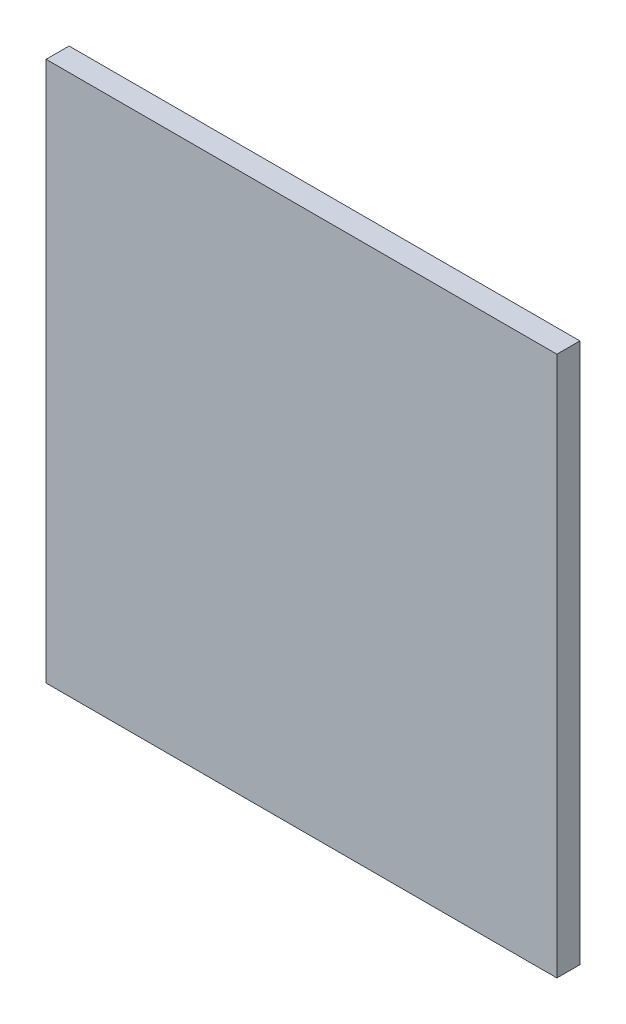
ISO-10303-21;
HEADER;
FILE_DESCRIPTION(('STEP AP214'),'2;1');
FILE_NAME('part.step','',(''),(''),'','','');
FILE_SCHEMA(('AUTOMOTIVE_DESIGN { 1 0 10303 214 1 1 1 1 }'));
ENDSEC;
DATA;
#1=APPLICATION_CONTEXT('core data for automotive mechanical design processes');
#2=APPLICATION_PROTOCOL_DEFINITION('international standard','automotive_design',2000,#1);
#3=PRODUCT_CONTEXT('',#1,'mechanical');
#4=PRODUCT('Part','Part','',(#3));
#5=PRODUCT_RELATED_PRODUCT_CATEGORY('part','',(#4));
#6=PRODUCT_DEFINITION_FORMATION('','',#4);
#7=PRODUCT_DEFINITION_CONTEXT('part definition',#1,'design');
#8=PRODUCT_DEFINITION('design','',#6,#7);
#9=PRODUCT_DEFINITION_SHAPE('','',#8);
#10=(LENGTH_UNIT() NAMED_UNIT(*) SI_UNIT(.MILLI.,.METRE.));
#11=(NAMED_UNIT(*) PLANE_ANGLE_UNIT() SI_UNIT($,.RADIAN.));
#12=(NAMED_UNIT(*) SI_UNIT($,.STERADIAN.) SOLID_ANGLE_UNIT());
#13=UNCERTAINTY_MEASURE_WITH_UNIT(LENGTH_MEASURE(1.E-05),#10,'distance_accuracy_value','');
#14=(GEOMETRIC_REPRESENTATION_CONTEXT(3) GLOBAL_UNCERTAINTY_ASSIGNED_CONTEXT((#13)) GLOBAL_UNIT_ASSIGNED_CONTEXT((#10,
#11,#12)) REPRESENTATION_CONTEXT('',''));
#15=CARTESIAN_POINT('',(0.,0.,0.));
#16=DIRECTION('',(0.,0.,1.));
#17=DIRECTION('',(1.,0.,0.));
#18=AXIS2_PLACEMENT_3D('',#15,#16,#17);
#19=CARTESIAN_POINT('',(27.75,-29.35,2.5));
#20=DIRECTION('',(-1.,0.,0.));
#21=DIRECTION('',(0.,0.,1.));
#22=AXIS2_PLACEMENT_3D('',#19,#20,#21);
#23=PLANE('',#22);
#24=DIRECTION('',(0.,1.,0.));
#25=VECTOR('',#24,1.);
#26=CARTESIAN_POINT('',(27.75,-29.35,0.));
#27=LINE('',#26,#25);
#28=CARTESIAN_POINT('',(27.75,-29.35,0.));
#29=VERTEX_POINT('',#28);
#30=CARTESIAN_POINT('',(27.75,29.35,0.));
#31=VERTEX_POINT('',#30);
#32=EDGE_CURVE('E97',#29,#31,#27,.T.);
#33=ORIENTED_EDGE('',*,*,#32,.T.);
#34=DIRECTION('',(0.,0.,-1.));
#35=VECTOR('',#34,1.);
#36=CARTESIAN_POINT('',(27.75,29.35,2.5));
#37=LINE('',#36,#35);
#38=CARTESIAN_POINT('',(27.75,29.35,2.5));
#39=VERTEX_POINT('',#38);
#40=EDGE_CURVE('E11',#39,#31,#37,.T.);
#41=ORIENTED_EDGE('',*,*,#40,.F.);
#42=DIRECTION('',(0.,1.,0.));
#43=VECTOR('',#42,1.);
#44=CARTESIAN_POINT('',(27.75,-29.35,2.5));
#45=LINE('',#44,#43);
#46=CARTESIAN_POINT('',(27.75,-29.35,2.5));
#47=VERTEX_POINT('',#46);
#48=EDGE_CURVE('E85',#47,#39,#45,.T.);
#49=ORIENTED_EDGE('',*,*,#48,.F.);
#50=DIRECTION('',(0.,0.,-1.));
#51=VECTOR('',#50,1.);
#52=CARTESIAN_POINT('',(27.75,-29.35,2.5));
#53=LINE('',#52,#51);
#54=EDGE_CURVE('E93',#47,#29,#53,.T.);
#55=ORIENTED_EDGE('',*,*,#54,.T.);
#56=EDGE_LOOP('',(#33,#41,#49,#55));
#57=FACE_BOUND('',#56,.T.);
#58=ADVANCED_FACE('F34',(#57),#23,.F.);
#59=CARTESIAN_POINT('',(-27.75,29.35,2.5));
#60=DIRECTION('',(0.,-1.,0.));
#61=DIRECTION('',(0.,0.,-1.));
#62=AXIS2_PLACEMENT_3D('',#59,#60,#61);
#63=PLANE('',#62);
#64=DIRECTION('',(-1.,0.,0.));
#65=VECTOR('',#64,1.);
#66=CARTESIAN_POINT('',(-27.75,29.35,0.));
#67=LINE('',#66,#65);
#68=CARTESIAN_POINT('',(-27.75,29.35,0.));
#69=VERTEX_POINT('',#68);
#70=EDGE_CURVE('E89',#31,#69,#67,.T.);
#71=ORIENTED_EDGE('',*,*,#70,.T.);
#72=DIRECTION('',(0.,0.,-1.));
#73=VECTOR('',#72,1.);
#74=CARTESIAN_POINT('',(-27.75,29.35,2.5));
#75=LINE('',#74,#73);
#76=CARTESIAN_POINT('',(-27.75,29.35,2.5));
#77=VERTEX_POINT('',#76);
#78=EDGE_CURVE('E42',#77,#69,#75,.T.);
#79=ORIENTED_EDGE('',*,*,#78,.F.);
#80=DIRECTION('',(-1.,0.,0.));
#81=VECTOR('',#80,1.);
#82=CARTESIAN_POINT('',(-27.75,29.35,2.5));
#83=LINE('',#82,#81);
#84=EDGE_CURVE('E80',#39,#77,#83,.T.);
#85=ORIENTED_EDGE('',*,*,#84,.F.);
#86=ORIENTED_EDGE('',*,*,#40,.T.);
#87=EDGE_LOOP('',(#71,#79,#85,#86));
#88=FACE_BOUND('',#87,.T.);
#89=ADVANCED_FACE('F88',(#88),#63,.F.);
#90=CARTESIAN_POINT('',(-27.75,-29.35,2.5));
#91=DIRECTION('',(1.,0.,0.));
#92=DIRECTION('',(0.,0.,-1.));
#93=AXIS2_PLACEMENT_3D('',#90,#91,#92);
#94=PLANE('',#93);
#95=DIRECTION('',(0.,-1.,0.));
#96=VECTOR('',#95,1.);
#97=CARTESIAN_POINT('',(-27.75,-29.35,0.));
#98=LINE('',#97,#96);
#99=CARTESIAN_POINT('',(-27.75,-29.35,0.));
#100=VERTEX_POINT('',#99);
#101=EDGE_CURVE('E67',#69,#100,#98,.T.);
#102=ORIENTED_EDGE('',*,*,#101,.T.);
#103=DIRECTION('',(0.,0.,-1.));
#104=VECTOR('',#103,1.);
#105=CARTESIAN_POINT('',(-27.75,-29.35,2.5));
#106=LINE('',#105,#104);
#107=CARTESIAN_POINT('',(-27.75,-29.35,2.5));
#108=VERTEX_POINT('',#107);
#109=EDGE_CURVE('E90',#108,#100,#106,.T.);
#110=ORIENTED_EDGE('',*,*,#109,.F.);
#111=DIRECTION('',(0.,-1.,0.));
#112=VECTOR('',#111,1.);
#113=CARTESIAN_POINT('',(-27.75,-29.35,2.5));
#114=LINE('',#113,#112);
#115=EDGE_CURVE('E83',#77,#108,#114,.T.);
#116=ORIENTED_EDGE('',*,*,#115,.F.);
#117=ORIENTED_EDGE('',*,*,#78,.T.);
#118=EDGE_LOOP('',(#102,#110,#116,#117));
#119=FACE_BOUND('',#118,.T.);
#120=ADVANCED_FACE('F91',(#119),#94,.F.);
#121=CARTESIAN_POINT('',(-27.75,-29.35,2.5));
#122=DIRECTION('',(0.,1.,0.));
#123=DIRECTION('',(0.,0.,1.));
#124=AXIS2_PLACEMENT_3D('',#121,#122,#123);
#125=PLANE('',#124);
#126=DIRECTION('',(1.,0.,0.));
#127=VECTOR('',#126,1.);
#128=CARTESIAN_POINT('',(-27.75,-29.35,0.));
#129=LINE('',#128,#127);
#130=EDGE_CURVE('E73',#100,#29,#129,.T.);
#131=ORIENTED_EDGE('',*,*,#130,.T.);
#132=ORIENTED_EDGE('',*,*,#54,.F.);
#133=DIRECTION('',(1.,0.,0.));
#134=VECTOR('',#133,1.);
#135=CARTESIAN_POINT('',(-27.75,-29.35,2.5));
#136=LINE('',#135,#134);
#137=EDGE_CURVE('E50',#108,#47,#136,.T.);
#138=ORIENTED_EDGE('',*,*,#137,.F.);
#139=ORIENTED_EDGE('',*,*,#109,.T.);
#140=EDGE_LOOP('',(#131,#132,#138,#139));
#141=FACE_BOUND('',#140,.T.);
#142=ADVANCED_FACE('F104',(#141),#125,.F.);
#143=CARTESIAN_POINT('',(0.,0.,2.5));
#144=DIRECTION('',(0.,0.,-1.));
#145=DIRECTION('',(-1.,0.,0.));
#146=AXIS2_PLACEMENT_3D('',#143,#144,#145);
#147=PLANE('',#146);
#148=ORIENTED_EDGE('',*,*,#48,.T.);
#149=ORIENTED_EDGE('',*,*,#84,.T.);
#150=ORIENTED_EDGE('',*,*,#115,.T.);
#151=ORIENTED_EDGE('',*,*,#137,.T.);
#152=EDGE_LOOP('',(#148,#149,#150,#151));
#153=FACE_BOUND('',#152,.T.);
#154=ADVANCED_FACE('F81',(#153),#147,.F.);
#155=CARTESIAN_POINT('',(0.,0.,0.));
#156=DIRECTION('',(0.,0.,-1.));
#157=DIRECTION('',(-1.,0.,0.));
#158=AXIS2_PLACEMENT_3D('',#155,#156,#157);
#159=PLANE('',#158);
#160=ORIENTED_EDGE('',*,*,#32,.F.);
#161=ORIENTED_EDGE('',*,*,#130,.F.);
#162=ORIENTED_EDGE('',*,*,#101,.F.);
#163=ORIENTED_EDGE('',*,*,#70,.F.);
#164=EDGE_LOOP('',(#160,#161,#162,#163));
#165=FACE_BOUND('',#164,.T.);
#166=ADVANCED_FACE('F107',(#165),#159,.T.);
#167=CLOSED_SHELL('',(#58,#89,#120,#142,#154,#166));
#168=MANIFOLD_SOLID_BREP('B2',#167);
#169=ADVANCED_BREP_SHAPE_REPRESENTATION('',(#18,#168),#14);
#170=SHAPE_DEFINITION_REPRESENTATION(#9,#169);
ENDSEC;
END-ISO-10303-21;
